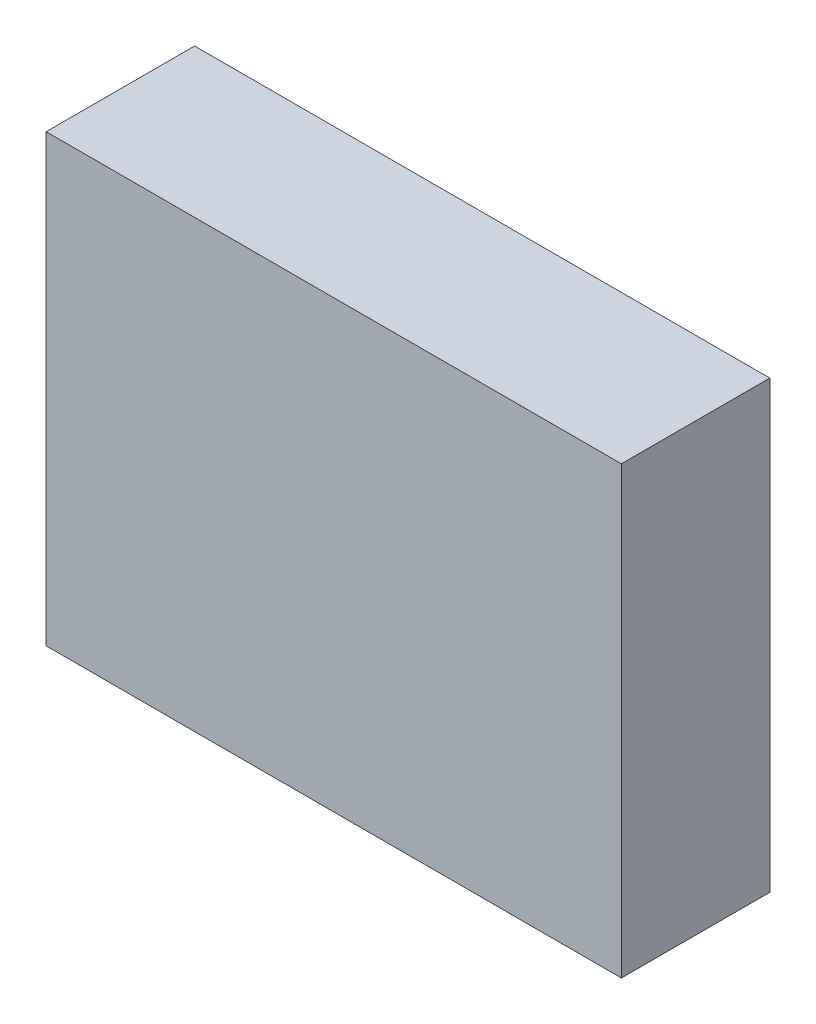
ISO-10303-21;
HEADER;
FILE_DESCRIPTION(('STEP AP214'),'2;1');
FILE_NAME('part.step','',(''),(''),'','','');
FILE_SCHEMA(('AUTOMOTIVE_DESIGN { 1 0 10303 214 1 1 1 1 }'));
ENDSEC;
DATA;
#1=APPLICATION_CONTEXT('core data for automotive mechanical design processes');
#2=APPLICATION_PROTOCOL_DEFINITION('international standard','automotive_design',2000,#1);
#3=PRODUCT_CONTEXT('',#1,'mechanical');
#4=PRODUCT('Part','Part','',(#3));
#5=PRODUCT_RELATED_PRODUCT_CATEGORY('part','',(#4));
#6=PRODUCT_DEFINITION_FORMATION('','',#4);
#7=PRODUCT_DEFINITION_CONTEXT('part definition',#1,'design');
#8=PRODUCT_DEFINITION('design','',#6,#7);
#9=PRODUCT_DEFINITION_SHAPE('','',#8);
#10=(LENGTH_UNIT() NAMED_UNIT(*) SI_UNIT(.MILLI.,.METRE.));
#11=(NAMED_UNIT(*) PLANE_ANGLE_UNIT() SI_UNIT($,.RADIAN.));
#12=(NAMED_UNIT(*) SI_UNIT($,.STERADIAN.) SOLID_ANGLE_UNIT());
#13=UNCERTAINTY_MEASURE_WITH_UNIT(LENGTH_MEASURE(1.E-05),#10,'distance_accuracy_value','');
#14=(GEOMETRIC_REPRESENTATION_CONTEXT(3) GLOBAL_UNCERTAINTY_ASSIGNED_CONTEXT((#13)) GLOBAL_UNIT_ASSIGNED_CONTEXT((#10,
#11,#12)) REPRESENTATION_CONTEXT('',''));
#15=CARTESIAN_POINT('',(0.,0.,0.));
#16=DIRECTION('',(0.,0.,1.));
#17=DIRECTION('',(1.,0.,0.));
#18=AXIS2_PLACEMENT_3D('',#15,#16,#17);
#19=CARTESIAN_POINT('',(98.425,-76.2,50.8));
#20=DIRECTION('',(-1.,0.,0.));
#21=DIRECTION('',(0.,0.,1.));
#22=AXIS2_PLACEMENT_3D('',#19,#20,#21);
#23=PLANE('',#22);
#24=DIRECTION('',(0.,1.,0.));
#25=VECTOR('',#24,1.);
#26=CARTESIAN_POINT('',(98.425,-76.2,0.));
#27=LINE('',#26,#25);
#28=CARTESIAN_POINT('',(98.425,-76.2,0.));
#29=VERTEX_POINT('',#28);
#30=CARTESIAN_POINT('',(98.425,76.2,0.));
#31=VERTEX_POINT('',#30);
#32=EDGE_CURVE('E98',#29,#31,#27,.T.);
#33=ORIENTED_EDGE('',*,*,#32,.T.);
#34=DIRECTION('',(0.,0.,-1.));
#35=VECTOR('',#34,1.);
#36=CARTESIAN_POINT('',(98.425,76.2,50.8));
#37=LINE('',#36,#35);
#38=CARTESIAN_POINT('',(98.425,76.2,50.8));
#39=VERTEX_POINT('',#38);
#40=EDGE_CURVE('E11',#39,#31,#37,.T.);
#41=ORIENTED_EDGE('',*,*,#40,.F.);
#42=DIRECTION('',(0.,1.,0.));
#43=VECTOR('',#42,1.);
#44=CARTESIAN_POINT('',(98.425,-76.2,50.8));
#45=LINE('',#44,#43);
#46=CARTESIAN_POINT('',(98.425,-76.2,50.8));
#47=VERTEX_POINT('',#46);
#48=EDGE_CURVE('E86',#47,#39,#45,.T.);
#49=ORIENTED_EDGE('',*,*,#48,.F.);
#50=DIRECTION('',(0.,0.,-1.));
#51=VECTOR('',#50,1.);
#52=CARTESIAN_POINT('',(98.425,-76.2,50.8));
#53=LINE('',#52,#51);
#54=EDGE_CURVE('E94',#47,#29,#53,.T.);
#55=ORIENTED_EDGE('',*,*,#54,.T.);
#56=EDGE_LOOP('',(#33,#41,#49,#55));
#57=FACE_BOUND('',#56,.T.);
#58=ADVANCED_FACE('F35',(#57),#23,.F.);
#59=CARTESIAN_POINT('',(-98.425,76.2,50.8));
#60=DIRECTION('',(0.,-1.,0.));
#61=DIRECTION('',(0.,0.,-1.));
#62=AXIS2_PLACEMENT_3D('',#59,#60,#61);
#63=PLANE('',#62);
#64=DIRECTION('',(-1.,0.,0.));
#65=VECTOR('',#64,1.);
#66=CARTESIAN_POINT('',(-98.425,76.2,0.));
#67=LINE('',#66,#65);
#68=CARTESIAN_POINT('',(-98.425,76.2,0.));
#69=VERTEX_POINT('',#68);
#70=EDGE_CURVE('E90',#31,#69,#67,.T.);
#71=ORIENTED_EDGE('',*,*,#70,.T.);
#72=DIRECTION('',(0.,0.,-1.));
#73=VECTOR('',#72,1.);
#74=CARTESIAN_POINT('',(-98.425,76.2,50.8));
#75=LINE('',#74,#73);
#76=CARTESIAN_POINT('',(-98.425,76.2,50.8));
#77=VERTEX_POINT('',#76);
#78=EDGE_CURVE('E43',#77,#69,#75,.T.);
#79=ORIENTED_EDGE('',*,*,#78,.F.);
#80=DIRECTION('',(-1.,0.,0.));
#81=VECTOR('',#80,1.);
#82=CARTESIAN_POINT('',(-98.425,76.2,50.8));
#83=LINE('',#82,#81);
#84=EDGE_CURVE('E81',#39,#77,#83,.T.);
#85=ORIENTED_EDGE('',*,*,#84,.F.);
#86=ORIENTED_EDGE('',*,*,#40,.T.);
#87=EDGE_LOOP('',(#71,#79,#85,#86));
#88=FACE_BOUND('',#87,.T.);
#89=ADVANCED_FACE('F89',(#88),#63,.F.);
#90=CARTESIAN_POINT('',(-98.425,-76.2,50.8));
#91=DIRECTION('',(1.,0.,0.));
#92=DIRECTION('',(0.,0.,-1.));
#93=AXIS2_PLACEMENT_3D('',#90,#91,#92);
#94=PLANE('',#93);
#95=DIRECTION('',(0.,-1.,0.));
#96=VECTOR('',#95,1.);
#97=CARTESIAN_POINT('',(-98.425,-76.2,0.));
#98=LINE('',#97,#96);
#99=CARTESIAN_POINT('',(-98.425,-76.2,0.));
#100=VERTEX_POINT('',#99);
#101=EDGE_CURVE('E68',#69,#100,#98,.T.);
#102=ORIENTED_EDGE('',*,*,#101,.T.);
#103=DIRECTION('',(0.,0.,-1.));
#104=VECTOR('',#103,1.);
#105=CARTESIAN_POINT('',(-98.425,-76.2,50.8));
#106=LINE('',#105,#104);
#107=CARTESIAN_POINT('',(-98.425,-76.2,50.8));
#108=VERTEX_POINT('',#107);
#109=EDGE_CURVE('E91',#108,#100,#106,.T.);
#110=ORIENTED_EDGE('',*,*,#109,.F.);
#111=DIRECTION('',(0.,-1.,0.));
#112=VECTOR('',#111,1.);
#113=CARTESIAN_POINT('',(-98.425,-76.2,50.8));
#114=LINE('',#113,#112);
#115=EDGE_CURVE('E84',#77,#108,#114,.T.);
#116=ORIENTED_EDGE('',*,*,#115,.F.);
#117=ORIENTED_EDGE('',*,*,#78,.T.);
#118=EDGE_LOOP('',(#102,#110,#116,#117));
#119=FACE_BOUND('',#118,.T.);
#120=ADVANCED_FACE('F92',(#119),#94,.F.);
#121=CARTESIAN_POINT('',(-98.425,-76.2,50.8));
#122=DIRECTION('',(0.,1.,0.));
#123=DIRECTION('',(0.,0.,1.));
#124=AXIS2_PLACEMENT_3D('',#121,#122,#123);
#125=PLANE('',#124);
#126=DIRECTION('',(1.,0.,0.));
#127=VECTOR('',#126,1.);
#128=CARTESIAN_POINT('',(-98.425,-76.2,0.));
#129=LINE('',#128,#127);
#130=EDGE_CURVE('E74',#100,#29,#129,.T.);
#131=ORIENTED_EDGE('',*,*,#130,.T.);
#132=ORIENTED_EDGE('',*,*,#54,.F.);
#133=DIRECTION('',(1.,0.,0.));
#134=VECTOR('',#133,1.);
#135=CARTESIAN_POINT('',(-98.425,-76.2,50.8));
#136=LINE('',#135,#134);
#137=EDGE_CURVE('E51',#108,#47,#136,.T.);
#138=ORIENTED_EDGE('',*,*,#137,.F.);
#139=ORIENTED_EDGE('',*,*,#109,.T.);
#140=EDGE_LOOP('',(#131,#132,#138,#139));
#141=FACE_BOUND('',#140,.T.);
#142=ADVANCED_FACE('F105',(#141),#125,.F.);
#143=CARTESIAN_POINT('',(0.,0.,50.8));
#144=DIRECTION('',(0.,0.,-1.));
#145=DIRECTION('',(-1.,0.,0.));
#146=AXIS2_PLACEMENT_3D('',#143,#144,#145);
#147=PLANE('',#146);
#148=ORIENTED_EDGE('',*,*,#48,.T.);
#149=ORIENTED_EDGE('',*,*,#84,.T.);
#150=ORIENTED_EDGE('',*,*,#115,.T.);
#151=ORIENTED_EDGE('',*,*,#137,.T.);
#152=EDGE_LOOP('',(#148,#149,#150,#151));
#153=FACE_BOUND('',#152,.T.);
#154=ADVANCED_FACE('F82',(#153),#147,.F.);
#155=CARTESIAN_POINT('',(0.,0.,0.));
#156=DIRECTION('',(0.,0.,-1.));
#157=DIRECTION('',(-1.,0.,0.));
#158=AXIS2_PLACEMENT_3D('',#155,#156,#157);
#159=PLANE('',#158);
#160=ORIENTED_EDGE('',*,*,#32,.F.);
#161=ORIENTED_EDGE('',*,*,#130,.F.);
#162=ORIENTED_EDGE('',*,*,#101,.F.);
#163=ORIENTED_EDGE('',*,*,#70,.F.);
#164=EDGE_LOOP('',(#160,#161,#162,#163));
#165=FACE_BOUND('',#164,.T.);
#166=ADVANCED_FACE('F108',(#165),#159,.T.);
#167=CLOSED_SHELL('',(#58,#89,#120,#142,#154,#166));
#168=MANIFOLD_SOLID_BREP('B2',#167);
#169=ADVANCED_BREP_SHAPE_REPRESENTATION('',(#18,#168),#14);
#170=SHAPE_DEFINITION_REPRESENTATION(#9,#169);
ENDSEC;
END-ISO-10303-21;
